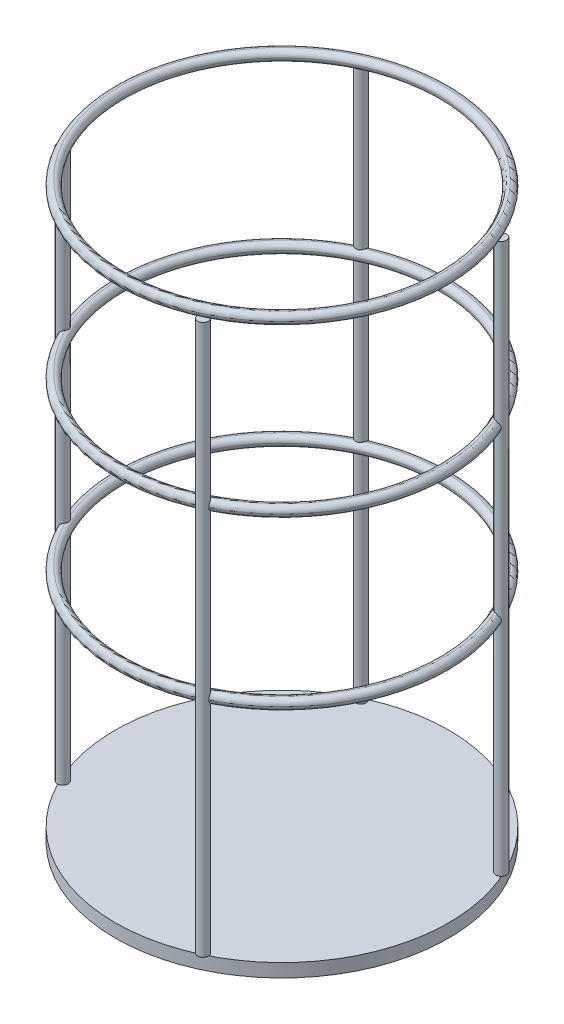
ISO-10303-21;
HEADER;
FILE_DESCRIPTION(('STEP AP214'),'2;1');
FILE_NAME('part.step','',(''),(''),'','','');
FILE_SCHEMA(('AUTOMOTIVE_DESIGN { 1 0 10303 214 1 1 1 1 }'));
ENDSEC;
DATA;
#1=APPLICATION_CONTEXT('core data for automotive mechanical design processes');
#2=APPLICATION_PROTOCOL_DEFINITION('international standard','automotive_design',2000,#1);
#3=PRODUCT_CONTEXT('',#1,'mechanical');
#4=PRODUCT('Part','Part','',(#3));
#5=PRODUCT_RELATED_PRODUCT_CATEGORY('part','',(#4));
#6=PRODUCT_DEFINITION_FORMATION('','',#4);
#7=PRODUCT_DEFINITION_CONTEXT('part definition',#1,'design');
#8=PRODUCT_DEFINITION('design','',#6,#7);
#9=PRODUCT_DEFINITION_SHAPE('','',#8);
#10=(LENGTH_UNIT() NAMED_UNIT(*) SI_UNIT(.MILLI.,.METRE.));
#11=(NAMED_UNIT(*) PLANE_ANGLE_UNIT() SI_UNIT($,.RADIAN.));
#12=(NAMED_UNIT(*) SI_UNIT($,.STERADIAN.) SOLID_ANGLE_UNIT());
#13=UNCERTAINTY_MEASURE_WITH_UNIT(LENGTH_MEASURE(1.E-05),#10,'distance_accuracy_value','');
#14=(GEOMETRIC_REPRESENTATION_CONTEXT(3) GLOBAL_UNCERTAINTY_ASSIGNED_CONTEXT((#13)) GLOBAL_UNIT_ASSIGNED_CONTEXT((#10,
#11,#12)) REPRESENTATION_CONTEXT('',''));
#15=CARTESIAN_POINT('',(0.,0.,0.));
#16=DIRECTION('',(0.,0.,1.));
#17=DIRECTION('',(1.,0.,0.));
#18=AXIS2_PLACEMENT_3D('',#15,#16,#17);
#19=CARTESIAN_POINT('',(162.767296420549,283.917533729383,-43.1274805345419));
#20=DIRECTION('',(-4.24118400981444E-06,0.999999999942017,-9.89844791380165E-06));
#21=DIRECTION('',(0.834404027641825,8.99442287995101E-06,0.551153262327458));
#22=AXIS2_PLACEMENT_3D('',#19,#20,#21);
#23=TOROIDAL_SURFACE('',#22,121.,4.);
#24=CARTESIAN_POINT('',(162.767296420549,283.917533729383,-43.1274805345419));
#25=DIRECTION('',(-4.24118400981444E-06,0.999999999942017,-9.89844791380165E-06));
#26=DIRECTION('',(0.834404027641825,8.99442287995101E-06,0.551153262327458));
#27=AXIS2_PLACEMENT_3D('',#24,#25,#26);
#28=CIRCLE('',#27,125.);
#29=CARTESIAN_POINT('',(267.067799875777,283.918658032243,25.7666772563903));
#30=VERTEX_POINT('',#29);
#31=EDGE_CURVE('P0_E21',#30,#30,#28,.F.);
#32=ORIENTED_EDGE('',*,*,#31,.F.);
#33=EDGE_LOOP('',(#32));
#34=FACE_BOUND('',#33,.T.);
#35=CARTESIAN_POINT('',(162.767279455813,287.917533729152,-43.1275201283336));
#36=DIRECTION('',(-4.24118400981444E-06,0.999999999942017,-9.89844791380165E-06));
#37=DIRECTION('',(0.834404027641825,8.99442287995101E-06,0.551153262327458));
#38=AXIS2_PLACEMENT_3D('',#35,#36,#37);
#39=CIRCLE('',#38,121.);
#40=CARTESIAN_POINT('',(263.730166800474,287.91862205432,23.5620246132889));
#41=VERTEX_POINT('',#40);
#42=EDGE_CURVE('P0_E10',#41,#41,#39,.T.);
#43=ORIENTED_EDGE('',*,*,#42,.F.);
#44=EDGE_LOOP('',(#43));
#45=FACE_BOUND('',#44,.T.);
#46=ADVANCED_FACE('P0_F15',(#34,#45),#23,.T.);
#47=CARTESIAN_POINT('',(162.767296420549,283.917533729383,-43.1274805345419));
#48=DIRECTION('',(-4.24118400981444E-06,0.999999999942017,-9.89844791380165E-06));
#49=DIRECTION('',(0.834404027641825,8.99442287995101E-06,0.551153262327458));
#50=AXIS2_PLACEMENT_3D('',#47,#48,#49);
#51=TOROIDAL_SURFACE('',#50,121.,4.);
#52=ORIENTED_EDGE('',*,*,#42,.T.);
#53=EDGE_LOOP('',(#52));
#54=FACE_BOUND('',#53,.T.);
#55=CARTESIAN_POINT('',(162.767296420549,283.917533729383,-43.1274805345419));
#56=DIRECTION('',(-4.24118400981444E-06,0.999999999942017,-9.89844791380165E-06));
#57=DIRECTION('',(0.834404027641825,8.99442287995101E-06,0.551153262327458));
#58=AXIS2_PLACEMENT_3D('',#55,#56,#57);
#59=CIRCLE('',#58,117.);
#60=CARTESIAN_POINT('',(260.392567654642,283.91858607686,21.3574511577707));
#61=VERTEX_POINT('',#60);
#62=EDGE_CURVE('P0_E25',#61,#61,#59,.T.);
#63=ORIENTED_EDGE('',*,*,#62,.F.);
#64=EDGE_LOOP('',(#63));
#65=FACE_BOUND('',#64,.T.);
#66=ADVANCED_FACE('P0_F39',(#54,#65),#51,.T.);
#67=CARTESIAN_POINT('',(162.767296420549,283.917533729383,-43.1274805345419));
#68=DIRECTION('',(-4.24118400981444E-06,0.999999999942017,-9.89844791380165E-06));
#69=DIRECTION('',(0.834404027641825,8.99442287995101E-06,0.551153262327458));
#70=AXIS2_PLACEMENT_3D('',#67,#68,#69);
#71=TOROIDAL_SURFACE('',#70,121.,4.);
#72=ORIENTED_EDGE('',*,*,#31,.T.);
#73=EDGE_LOOP('',(#72));
#74=FACE_BOUND('',#73,.T.);
#75=CARTESIAN_POINT('',(162.767313385285,279.917533729615,-43.1274409407503));
#76=DIRECTION('',(-4.24118400981444E-06,0.999999999942017,-9.89844791380165E-06));
#77=DIRECTION('',(0.834404027641825,8.99442287995101E-06,0.551153262327458));
#78=AXIS2_PLACEMENT_3D('',#75,#76,#77);
#79=CIRCLE('',#78,121.);
#80=CARTESIAN_POINT('',(263.730200729946,279.918622054784,23.5621038008722));
#81=VERTEX_POINT('',#80);
#82=EDGE_CURVE('P0_E29',#81,#81,#79,.F.);
#83=ORIENTED_EDGE('',*,*,#82,.F.);
#84=EDGE_LOOP('',(#83));
#85=FACE_BOUND('',#84,.T.);
#86=ADVANCED_FACE('P0_F37',(#74,#85),#71,.T.);
#87=CARTESIAN_POINT('',(162.767296420549,283.917533729383,-43.1274805345419));
#88=DIRECTION('',(-4.24118400981444E-06,0.999999999942017,-9.89844791380165E-06));
#89=DIRECTION('',(0.834404027641825,8.99442287995101E-06,0.551153262327458));
#90=AXIS2_PLACEMENT_3D('',#87,#88,#89);
#91=TOROIDAL_SURFACE('',#90,121.,4.);
#92=ORIENTED_EDGE('',*,*,#62,.T.);
#93=EDGE_LOOP('',(#92));
#94=FACE_BOUND('',#93,.T.);
#95=ORIENTED_EDGE('',*,*,#82,.T.);
#96=EDGE_LOOP('',(#95));
#97=FACE_BOUND('',#96,.T.);
#98=ADVANCED_FACE('P0_F35',(#94,#97),#91,.T.);
#99=CLOSED_SHELL('',(#46,#66,#86,#98));
#100=MANIFOLD_SOLID_BREP('P0_B1',#99);
#101=CARTESIAN_POINT('',(162.766589262561,158.917533743879,-43.1257130805516));
#102=DIRECTION('',(-4.24118400981444E-06,0.999999999942017,-9.89844791380165E-06));
#103=DIRECTION('',(0.834404027641825,8.99442287995101E-06,0.551153262327458));
#104=AXIS2_PLACEMENT_3D('',#101,#102,#103);
#105=TOROIDAL_SURFACE('',#104,121.,4.);
#106=CARTESIAN_POINT('',(162.766589262561,158.917533743879,-43.1257130805516));
#107=DIRECTION('',(-4.24118400981444E-06,0.999999999942017,-9.89844791380165E-06));
#108=DIRECTION('',(0.834404027641825,8.99442287995101E-06,0.551153262327458));
#109=AXIS2_PLACEMENT_3D('',#106,#107,#108);
#110=CIRCLE('',#109,125.);
#111=CARTESIAN_POINT('',(267.067092717789,158.918658046739,25.7684447103807));
#112=VERTEX_POINT('',#111);
#113=EDGE_CURVE('P1_E21',#112,#112,#110,.F.);
#114=ORIENTED_EDGE('',*,*,#113,.F.);
#115=EDGE_LOOP('',(#114));
#116=FACE_BOUND('',#115,.T.);
#117=CARTESIAN_POINT('',(162.766572297825,162.917533743647,-43.1257526743432));
#118=DIRECTION('',(-4.24118400981444E-06,0.999999999942017,-9.89844791380165E-06));
#119=DIRECTION('',(0.834404027641825,8.99442287995101E-06,0.551153262327458));
#120=AXIS2_PLACEMENT_3D('',#117,#118,#119);
#121=CIRCLE('',#120,121.);
#122=CARTESIAN_POINT('',(263.729459642485,162.918622068816,23.5637920672792));
#123=VERTEX_POINT('',#122);
#124=EDGE_CURVE('P1_E10',#123,#123,#121,.T.);
#125=ORIENTED_EDGE('',*,*,#124,.F.);
#126=EDGE_LOOP('',(#125));
#127=FACE_BOUND('',#126,.T.);
#128=ADVANCED_FACE('P1_F15',(#116,#127),#105,.T.);
#129=CARTESIAN_POINT('',(162.766589262561,158.917533743879,-43.1257130805516));
#130=DIRECTION('',(-4.24118400981444E-06,0.999999999942017,-9.89844791380165E-06));
#131=DIRECTION('',(0.834404027641825,8.99442287995101E-06,0.551153262327458));
#132=AXIS2_PLACEMENT_3D('',#129,#130,#131);
#133=TOROIDAL_SURFACE('',#132,121.,4.);
#134=ORIENTED_EDGE('',*,*,#124,.T.);
#135=EDGE_LOOP('',(#134));
#136=FACE_BOUND('',#135,.T.);
#137=CARTESIAN_POINT('',(162.766589262561,158.917533743879,-43.1257130805516));
#138=DIRECTION('',(-4.24118400981444E-06,0.999999999942017,-9.89844791380165E-06));
#139=DIRECTION('',(0.834404027641825,8.99442287995101E-06,0.551153262327458));
#140=AXIS2_PLACEMENT_3D('',#137,#138,#139);
#141=CIRCLE('',#140,117.);
#142=CARTESIAN_POINT('',(260.391860496654,158.918586091356,21.3592186117611));
#143=VERTEX_POINT('',#142);
#144=EDGE_CURVE('P1_E25',#143,#143,#141,.T.);
#145=ORIENTED_EDGE('',*,*,#144,.F.);
#146=EDGE_LOOP('',(#145));
#147=FACE_BOUND('',#146,.T.);
#148=ADVANCED_FACE('P1_F39',(#136,#147),#133,.T.);
#149=CARTESIAN_POINT('',(162.766589262561,158.917533743879,-43.1257130805516));
#150=DIRECTION('',(-4.24118400981444E-06,0.999999999942017,-9.89844791380165E-06));
#151=DIRECTION('',(0.834404027641825,8.99442287995101E-06,0.551153262327458));
#152=AXIS2_PLACEMENT_3D('',#149,#150,#151);
#153=TOROIDAL_SURFACE('',#152,121.,4.);
#154=ORIENTED_EDGE('',*,*,#113,.T.);
#155=EDGE_LOOP('',(#154));
#156=FACE_BOUND('',#155,.T.);
#157=CARTESIAN_POINT('',(162.766606227297,154.917533744111,-43.1256734867599));
#158=DIRECTION('',(-4.24118400981444E-06,0.999999999942017,-9.89844791380165E-06));
#159=DIRECTION('',(0.834404027641825,8.99442287995101E-06,0.551153262327458));
#160=AXIS2_PLACEMENT_3D('',#157,#158,#159);
#161=CIRCLE('',#160,121.);
#162=CARTESIAN_POINT('',(263.729493571958,154.91862206928,23.5638712548625));
#163=VERTEX_POINT('',#162);
#164=EDGE_CURVE('P1_E29',#163,#163,#161,.F.);
#165=ORIENTED_EDGE('',*,*,#164,.F.);
#166=EDGE_LOOP('',(#165));
#167=FACE_BOUND('',#166,.T.);
#168=ADVANCED_FACE('P1_F37',(#156,#167),#153,.T.);
#169=CARTESIAN_POINT('',(162.766589262561,158.917533743879,-43.1257130805516));
#170=DIRECTION('',(-4.24118400981444E-06,0.999999999942017,-9.89844791380165E-06));
#171=DIRECTION('',(0.834404027641825,8.99442287995101E-06,0.551153262327458));
#172=AXIS2_PLACEMENT_3D('',#169,#170,#171);
#173=TOROIDAL_SURFACE('',#172,121.,4.);
#174=ORIENTED_EDGE('',*,*,#144,.T.);
#175=EDGE_LOOP('',(#174));
#176=FACE_BOUND('',#175,.T.);
#177=ORIENTED_EDGE('',*,*,#164,.T.);
#178=EDGE_LOOP('',(#177));
#179=FACE_BOUND('',#178,.T.);
#180=ADVANCED_FACE('P1_F35',(#176,#179),#173,.T.);
#181=CLOSED_SHELL('',(#128,#148,#168,#180));
#182=MANIFOLD_SOLID_BREP('P1_B1',#181);
#183=CARTESIAN_POINT('',(162.765882104573,33.9175337583752,-43.1239456265612));
#184=DIRECTION('',(-4.24118400981444E-06,0.999999999942017,-9.89844791380165E-06));
#185=DIRECTION('',(0.834404027641825,8.99442287995101E-06,0.551153262327458));
#186=AXIS2_PLACEMENT_3D('',#183,#184,#185);
#187=TOROIDAL_SURFACE('',#186,121.,4.);
#188=CARTESIAN_POINT('',(162.765882104573,33.9175337583752,-43.1239456265612));
#189=DIRECTION('',(-4.24118400981444E-06,0.999999999942017,-9.89844791380165E-06));
#190=DIRECTION('',(0.834404027641825,8.99442287995101E-06,0.551153262327458));
#191=AXIS2_PLACEMENT_3D('',#188,#189,#190);
#192=CIRCLE('',#191,125.);
#193=CARTESIAN_POINT('',(267.066385559801,33.9186580612352,25.7702121643711));
#194=VERTEX_POINT('',#193);
#195=EDGE_CURVE('P2_E20',#194,#194,#192,.F.);
#196=ORIENTED_EDGE('',*,*,#195,.F.);
#197=EDGE_LOOP('',(#196));
#198=FACE_BOUND('',#197,.T.);
#199=CARTESIAN_POINT('',(162.765865139837,37.9175337581433,-43.1239852203528));
#200=DIRECTION('',(-4.24118400981444E-06,0.999999999942017,-9.89844791380165E-06));
#201=DIRECTION('',(0.834404027641825,8.99442287995101E-06,0.551153262327458));
#202=AXIS2_PLACEMENT_3D('',#199,#200,#201);
#203=CIRCLE('',#202,121.);
#204=CARTESIAN_POINT('',(263.728752484497,37.9186220833118,23.5655595212696));
#205=VERTEX_POINT('',#204);
#206=EDGE_CURVE('P2_E9',#205,#205,#203,.T.);
#207=ORIENTED_EDGE('',*,*,#206,.F.);
#208=EDGE_LOOP('',(#207));
#209=FACE_BOUND('',#208,.T.);
#210=ADVANCED_FACE('P2_F14',(#198,#209),#187,.T.);
#211=CARTESIAN_POINT('',(162.765882104573,33.9175337583752,-43.1239456265612));
#212=DIRECTION('',(-4.24118400981444E-06,0.999999999942017,-9.89844791380165E-06));
#213=DIRECTION('',(0.834404027641825,8.99442287995101E-06,0.551153262327458));
#214=AXIS2_PLACEMENT_3D('',#211,#212,#213);
#215=TOROIDAL_SURFACE('',#214,121.,4.);
#216=ORIENTED_EDGE('',*,*,#206,.T.);
#217=EDGE_LOOP('',(#216));
#218=FACE_BOUND('',#217,.T.);
#219=CARTESIAN_POINT('',(162.765882104573,33.9175337583752,-43.1239456265612));
#220=DIRECTION('',(-4.24118400981444E-06,0.999999999942017,-9.89844791380165E-06));
#221=DIRECTION('',(0.834404027641825,8.99442287995101E-06,0.551153262327458));
#222=AXIS2_PLACEMENT_3D('',#219,#220,#221);
#223=CIRCLE('',#222,117.);
#224=CARTESIAN_POINT('',(260.391153338666,33.9185861058522,21.3609860657514));
#225=VERTEX_POINT('',#224);
#226=EDGE_CURVE('P2_E24',#225,#225,#223,.T.);
#227=ORIENTED_EDGE('',*,*,#226,.F.);
#228=EDGE_LOOP('',(#227));
#229=FACE_BOUND('',#228,.T.);
#230=ADVANCED_FACE('P2_F38',(#218,#229),#215,.T.);
#231=CARTESIAN_POINT('',(162.765882104573,33.9175337583752,-43.1239456265612));
#232=DIRECTION('',(-4.24118400981444E-06,0.999999999942017,-9.89844791380165E-06));
#233=DIRECTION('',(0.834404027641825,8.99442287995101E-06,0.551153262327458));
#234=AXIS2_PLACEMENT_3D('',#231,#232,#233);
#235=TOROIDAL_SURFACE('',#234,121.,4.);
#236=ORIENTED_EDGE('',*,*,#195,.T.);
#237=EDGE_LOOP('',(#236));
#238=FACE_BOUND('',#237,.T.);
#239=CARTESIAN_POINT('',(162.765899069309,29.9175337586071,-43.1239060327695));
#240=DIRECTION('',(-4.24118400981444E-06,0.999999999942017,-9.89844791380165E-06));
#241=DIRECTION('',(0.834404027641825,8.99442287995101E-06,0.551153262327458));
#242=AXIS2_PLACEMENT_3D('',#239,#240,#241);
#243=CIRCLE('',#242,121.);
#244=CARTESIAN_POINT('',(263.72878641397,29.9186220837756,23.5656387088529));
#245=VERTEX_POINT('',#244);
#246=EDGE_CURVE('P2_E28',#245,#245,#243,.F.);
#247=ORIENTED_EDGE('',*,*,#246,.F.);
#248=EDGE_LOOP('',(#247));
#249=FACE_BOUND('',#248,.T.);
#250=ADVANCED_FACE('P2_F36',(#238,#249),#235,.T.);
#251=CARTESIAN_POINT('',(162.765882104573,33.9175337583752,-43.1239456265612));
#252=DIRECTION('',(-4.24118400981444E-06,0.999999999942017,-9.89844791380165E-06));
#253=DIRECTION('',(0.834404027641825,8.99442287995101E-06,0.551153262327458));
#254=AXIS2_PLACEMENT_3D('',#251,#252,#253);
#255=TOROIDAL_SURFACE('',#254,121.,4.);
#256=ORIENTED_EDGE('',*,*,#226,.T.);
#257=EDGE_LOOP('',(#256));
#258=FACE_BOUND('',#257,.T.);
#259=ORIENTED_EDGE('',*,*,#246,.T.);
#260=EDGE_LOOP('',(#259));
#261=FACE_BOUND('',#260,.T.);
#262=ADVANCED_FACE('P2_F34',(#258,#261),#255,.T.);
#263=CLOSED_SHELL('',(#210,#230,#250,#262));
#264=MANIFOLD_SOLID_BREP('P2_B1',#263);
#265=CARTESIAN_POINT('',(162.770825081858,-132.082454183985,-43.1192450322442));
#266=DIRECTION('',(8.48236801908888E-06,-0.999999999768066,1.97968958263428E-05));
#267=DIRECTION('',(8.39621596496115E-11,-1.97968958263428E-05,-0.999999999804042));
#268=AXIS2_PLACEMENT_3D('',#265,#266,#267);
#269=CYLINDRICAL_SURFACE('',#268,125.);
#270=CARTESIAN_POINT('',(162.770825081858,-132.082454183985,-43.1192450322442));
#271=DIRECTION('',(-8.48236801908888E-06,0.999999999768066,-1.97968958263428E-05));
#272=DIRECTION('',(-8.39621596496115E-11,1.97968958263428E-05,0.999999999804042));
#273=AXIS2_PLACEMENT_3D('',#270,#271,#272);
#274=CIRCLE('',#273,125.);
#275=CARTESIAN_POINT('',(162.770825071363,-132.079979572007,81.880754943261));
#276=VERTEX_POINT('',#275);
#277=EDGE_CURVE('P3_E10',#276,#276,#274,.T.);
#278=ORIENTED_EDGE('',*,*,#277,.F.);
#279=EDGE_LOOP('',(#278));
#280=FACE_BOUND('',#279,.T.);
#281=CARTESIAN_POINT('',(162.770909905538,-142.082454181665,-43.1190470632859));
#282=DIRECTION('',(-8.48236801908888E-06,0.999999999768066,-1.97968958263428E-05));
#283=DIRECTION('',(-8.39621596496115E-11,1.97968958263428E-05,0.999999999804042));
#284=AXIS2_PLACEMENT_3D('',#281,#282,#283);
#285=CIRCLE('',#284,125.);
#286=CARTESIAN_POINT('',(162.770909895043,-142.079979569687,81.8809529122193));
#287=VERTEX_POINT('',#286);
#288=EDGE_CURVE('P3_E18',#287,#287,#285,.T.);
#289=ORIENTED_EDGE('',*,*,#288,.T.);
#290=EDGE_LOOP('',(#289));
#291=FACE_BOUND('',#290,.T.);
#292=ADVANCED_FACE('P3_F15',(#280,#291),#269,.T.);
#293=CARTESIAN_POINT('',(162.770825081858,-132.082454183985,-43.1192450322442));
#294=DIRECTION('',(-8.48236801908888E-06,0.999999999768066,-1.97968958263428E-05));
#295=DIRECTION('',(-8.39621596496115E-11,1.97968958263428E-05,0.999999999804042));
#296=AXIS2_PLACEMENT_3D('',#293,#294,#295);
#297=PLANE('',#296);
#298=ORIENTED_EDGE('',*,*,#277,.T.);
#299=EDGE_LOOP('',(#298));
#300=FACE_BOUND('',#299,.T.);
#301=ADVANCED_FACE('P3_F30',(#300),#297,.T.);
#302=CARTESIAN_POINT('',(162.770909905538,-142.082454181665,-43.1190470632859));
#303=DIRECTION('',(-8.48236801908888E-06,0.999999999768066,-1.97968958263428E-05));
#304=DIRECTION('',(-8.39621596496115E-11,1.97968958263428E-05,0.999999999804042));
#305=AXIS2_PLACEMENT_3D('',#302,#303,#304);
#306=PLANE('',#305);
#307=ORIENTED_EDGE('',*,*,#288,.F.);
#308=EDGE_LOOP('',(#307));
#309=FACE_BOUND('',#308,.T.);
#310=ADVANCED_FACE('P3_F28',(#309),#306,.F.);
#311=CLOSED_SHELL('',(#292,#301,#310));
#312=MANIFOLD_SOLID_BREP('P3_B1',#311);
#313=CARTESIAN_POINT('',(51.0623898512348,279.917545719531,9.43961345081953));
#314=DIRECTION('',(0.,-1.,0.));
#315=DIRECTION('',(0.878405205040862,0.,-0.47791662008882));
#316=AXIS2_PLACEMENT_3D('',#313,#314,#315);
#317=CYLINDRICAL_SURFACE('',#316,4.);
#318=CARTESIAN_POINT('',(51.0623898512348,279.917545719531,9.43961345081953));
#319=DIRECTION('',(0.,1.,0.));
#320=DIRECTION('',(-0.878405205040862,0.,0.47791662008882));
#321=AXIS2_PLACEMENT_3D('',#318,#319,#320);
#322=CIRCLE('',#321,4.);
#323=CARTESIAN_POINT('',(47.5487690310713,279.917545719531,11.3512799311748));
#324=VERTEX_POINT('',#323);
#325=EDGE_CURVE('P4_E10',#324,#324,#322,.T.);
#326=ORIENTED_EDGE('',*,*,#325,.F.);
#327=EDGE_LOOP('',(#326));
#328=FACE_BOUND('',#327,.T.);
#329=CARTESIAN_POINT('',(51.0623898512348,-132.082454280469,9.43961345081953));
#330=DIRECTION('',(0.,1.,0.));
#331=DIRECTION('',(-0.878405205040862,0.,0.47791662008882));
#332=AXIS2_PLACEMENT_3D('',#329,#330,#331);
#333=CIRCLE('',#332,4.);
#334=CARTESIAN_POINT('',(47.5487690310713,-132.082454280469,11.3512799311748));
#335=VERTEX_POINT('',#334);
#336=EDGE_CURVE('P4_E18',#335,#335,#333,.T.);
#337=ORIENTED_EDGE('',*,*,#336,.T.);
#338=EDGE_LOOP('',(#337));
#339=FACE_BOUND('',#338,.T.);
#340=ADVANCED_FACE('P4_F15',(#328,#339),#317,.T.);
#341=CARTESIAN_POINT('',(51.0623898512348,279.917545719531,9.43961345081953));
#342=DIRECTION('',(0.,1.,0.));
#343=DIRECTION('',(-0.878405205040862,0.,0.47791662008882));
#344=AXIS2_PLACEMENT_3D('',#341,#342,#343);
#345=PLANE('',#344);
#346=ORIENTED_EDGE('',*,*,#325,.T.);
#347=EDGE_LOOP('',(#346));
#348=FACE_BOUND('',#347,.T.);
#349=ADVANCED_FACE('P4_F30',(#348),#345,.T.);
#350=CARTESIAN_POINT('',(51.0623898512348,-132.082454280469,9.43961345081953));
#351=DIRECTION('',(0.,1.,0.));
#352=DIRECTION('',(-0.878405205040862,0.,0.47791662008882));
#353=AXIS2_PLACEMENT_3D('',#350,#351,#352);
#354=PLANE('',#353);
#355=ORIENTED_EDGE('',*,*,#336,.F.);
#356=EDGE_LOOP('',(#355));
#357=FACE_BOUND('',#356,.T.);
#358=ADVANCED_FACE('P4_F28',(#357),#354,.F.);
#359=CLOSED_SHELL('',(#340,#349,#358));
#360=MANIFOLD_SOLID_BREP('P4_B1',#359);
#361=CARTESIAN_POINT('',(110.20025899679,279.916170496498,-154.83236446793));
#362=DIRECTION('',(1.41396319233701E-05,-0.999999999884033,5.65726390341316E-06));
#363=DIRECTION('',(0.477916620056855,1.17269351577284E-05,0.878405204979974));
#364=AXIS2_PLACEMENT_3D('',#361,#362,#363);
#365=CYLINDRICAL_SURFACE('',#364,4.);
#366=CARTESIAN_POINT('',(110.20025899679,279.916170496498,-154.83236446793));
#367=DIRECTION('',(-1.41396319233701E-05,0.999999999884033,-5.65726390341316E-06));
#368=DIRECTION('',(-0.477916620056855,-1.17269351577284E-05,-0.878405204979974));
#369=AXIS2_PLACEMENT_3D('',#366,#367,#368);
#370=CIRCLE('',#369,4.);
#371=CARTESIAN_POINT('',(108.288592516562,279.916123588758,-158.345985287849));
#372=VERTEX_POINT('',#371);
#373=EDGE_CURVE('P5_E10',#372,#372,#370,.T.);
#374=ORIENTED_EDGE('',*,*,#373,.F.);
#375=EDGE_LOOP('',(#374));
#376=FACE_BOUND('',#375,.T.);
#377=CARTESIAN_POINT('',(110.206084525142,-132.083829455723,-154.830033675201));
#378=DIRECTION('',(-1.41396319233701E-05,0.999999999884033,-5.65726390341316E-06));
#379=DIRECTION('',(-0.477916620056855,-1.17269351577284E-05,-0.878405204979974));
#380=AXIS2_PLACEMENT_3D('',#377,#378,#379);
#381=CIRCLE('',#380,4.);
#382=CARTESIAN_POINT('',(108.294418044915,-132.083876363464,-158.343654495121));
#383=VERTEX_POINT('',#382);
#384=EDGE_CURVE('P5_E18',#383,#383,#381,.T.);
#385=ORIENTED_EDGE('',*,*,#384,.T.);
#386=EDGE_LOOP('',(#385));
#387=FACE_BOUND('',#386,.T.);
#388=ADVANCED_FACE('P5_F15',(#376,#387),#365,.T.);
#389=CARTESIAN_POINT('',(110.20025899679,279.916170496498,-154.83236446793));
#390=DIRECTION('',(-1.41396319233701E-05,0.999999999884033,-5.65726390341316E-06));
#391=DIRECTION('',(-0.477916620056855,-1.17269351577284E-05,-0.878405204979974));
#392=AXIS2_PLACEMENT_3D('',#389,#390,#391);
#393=PLANE('',#392);
#394=ORIENTED_EDGE('',*,*,#373,.T.);
#395=EDGE_LOOP('',(#394));
#396=FACE_BOUND('',#395,.T.);
#397=ADVANCED_FACE('P5_F30',(#396),#393,.T.);
#398=CARTESIAN_POINT('',(110.206084525142,-132.083829455723,-154.830033675201));
#399=DIRECTION('',(-1.41396319233701E-05,0.999999999884033,-5.65726390341316E-06));
#400=DIRECTION('',(-0.477916620056855,-1.17269351577284E-05,-0.878405204979974));
#401=AXIS2_PLACEMENT_3D('',#398,#399,#400);
#402=PLANE('',#401);
#403=ORIENTED_EDGE('',*,*,#384,.F.);
#404=EDGE_LOOP('',(#403));
#405=FACE_BOUND('',#404,.T.);
#406=ADVANCED_FACE('P5_F28',(#405),#402,.F.);
#407=CLOSED_SHELL('',(#388,#397,#406));
#408=MANIFOLD_SOLID_BREP('P5_B1',#407);
#409=CARTESIAN_POINT('',(215.334367774072,279.918827800334,68.5774825871139));
#410=DIRECTION('',(-5.65726390423311E-06,-0.999999999884033,1.41396319230422E-05));
#411=DIRECTION('',(-0.477916620065375,-9.71662583518054E-06,-0.878405204999877));
#412=AXIS2_PLACEMENT_3D('',#409,#410,#411);
#413=CYLINDRICAL_SURFACE('',#412,4.);
#414=CARTESIAN_POINT('',(215.334367774072,279.918827800334,68.5774825871139));
#415=DIRECTION('',(5.65726390423311E-06,0.999999999884033,-1.41396319230422E-05));
#416=DIRECTION('',(0.477916620065375,9.71662583518054E-06,0.878405204999877));
#417=AXIS2_PLACEMENT_3D('',#414,#415,#416);
#418=CIRCLE('',#417,4.);
#419=CARTESIAN_POINT('',(217.246034254334,279.918866666837,72.0911034071134));
#420=VERTEX_POINT('',#419);
#421=EDGE_CURVE('P6_E10',#420,#420,#418,.T.);
#422=ORIENTED_EDGE('',*,*,#421,.F.);
#423=EDGE_LOOP('',(#422));
#424=FACE_BOUND('',#423,.T.);
#425=CARTESIAN_POINT('',(215.332036981344,-132.081172151888,68.5833081154662));
#426=DIRECTION('',(5.65726390423311E-06,0.999999999884033,-1.41396319230422E-05));
#427=DIRECTION('',(0.477916620065375,9.71662583518054E-06,0.878405204999877));
#428=AXIS2_PLACEMENT_3D('',#425,#426,#427);
#429=CIRCLE('',#428,4.);
#430=CARTESIAN_POINT('',(217.243703461605,-132.081133285384,72.0969289354657));
#431=VERTEX_POINT('',#430);
#432=EDGE_CURVE('P6_E18',#431,#431,#429,.T.);
#433=ORIENTED_EDGE('',*,*,#432,.T.);
#434=EDGE_LOOP('',(#433));
#435=FACE_BOUND('',#434,.T.);
#436=ADVANCED_FACE('P6_F15',(#424,#435),#413,.T.);
#437=CARTESIAN_POINT('',(215.334367774072,279.918827800334,68.5774825871139));
#438=DIRECTION('',(5.65726390423311E-06,0.999999999884033,-1.41396319230422E-05));
#439=DIRECTION('',(0.477916620065375,9.71662583518054E-06,0.878405204999877));
#440=AXIS2_PLACEMENT_3D('',#437,#438,#439);
#441=PLANE('',#440);
#442=ORIENTED_EDGE('',*,*,#421,.T.);
#443=EDGE_LOOP('',(#442));
#444=FACE_BOUND('',#443,.T.);
#445=ADVANCED_FACE('P6_F30',(#444),#441,.T.);
#446=CARTESIAN_POINT('',(215.332036981344,-132.081172151888,68.5833081154662));
#447=DIRECTION('',(5.65726390423311E-06,0.999999999884033,-1.41396319230422E-05));
#448=DIRECTION('',(0.477916620065375,9.71662583518054E-06,0.878405204999877));
#449=AXIS2_PLACEMENT_3D('',#446,#447,#448);
#450=PLANE('',#449);
#451=ORIENTED_EDGE('',*,*,#432,.F.);
#452=EDGE_LOOP('',(#451));
#453=FACE_BOUND('',#452,.T.);
#454=ADVANCED_FACE('P6_F28',(#453),#450,.F.);
#455=CLOSED_SHELL('',(#436,#445,#454));
#456=MANIFOLD_SOLID_BREP('P6_B1',#455);
#457=CARTESIAN_POINT('',(274.472236919628,279.917452577302,-95.6944953316363));
#458=DIRECTION('',(8.48236801913712E-06,-0.999999999768066,1.97968958264554E-05));
#459=DIRECTION('',(-0.878405205049385,2.01030932254798E-06,0.477916620068927));
#460=AXIS2_PLACEMENT_3D('',#457,#458,#459);
#461=CYLINDRICAL_SURFACE('',#460,4.);
#462=CARTESIAN_POINT('',(274.472236919628,279.917452577302,-95.6944953316363));
#463=DIRECTION('',(-8.48236801913712E-06,0.999999999768066,-1.97968958264554E-05));
#464=DIRECTION('',(0.878405205049385,-2.01030932254798E-06,-0.477916620068927));
#465=AXIS2_PLACEMENT_3D('',#462,#463,#464);
#466=CIRCLE('',#465,4.);
#467=CARTESIAN_POINT('',(277.985857739825,279.917444536065,-97.606161811912));
#468=VERTEX_POINT('',#467);
#469=EDGE_CURVE('P7_E10',#468,#468,#466,.T.);
#470=ORIENTED_EDGE('',*,*,#469,.F.);
#471=EDGE_LOOP('',(#470));
#472=FACE_BOUND('',#471,.T.);
#473=CARTESIAN_POINT('',(274.475731655252,-132.082547327141,-95.6863390105558));
#474=DIRECTION('',(-8.48236801913712E-06,0.999999999768066,-1.97968958264554E-05));
#475=DIRECTION('',(0.878405205049385,-2.01030932254798E-06,-0.477916620068927));
#476=AXIS2_PLACEMENT_3D('',#473,#474,#475);
#477=CIRCLE('',#476,4.);
#478=CARTESIAN_POINT('',(277.989352475449,-132.082555368379,-97.5980054908315));
#479=VERTEX_POINT('',#478);
#480=EDGE_CURVE('P7_E18',#479,#479,#477,.T.);
#481=ORIENTED_EDGE('',*,*,#480,.T.);
#482=EDGE_LOOP('',(#481));
#483=FACE_BOUND('',#482,.T.);
#484=ADVANCED_FACE('P7_F15',(#472,#483),#461,.T.);
#485=CARTESIAN_POINT('',(274.472236919628,279.917452577302,-95.6944953316363));
#486=DIRECTION('',(-8.48236801913712E-06,0.999999999768066,-1.97968958264554E-05));
#487=DIRECTION('',(0.878405205049385,-2.01030932254798E-06,-0.477916620068927));
#488=AXIS2_PLACEMENT_3D('',#485,#486,#487);
#489=PLANE('',#488);
#490=ORIENTED_EDGE('',*,*,#469,.T.);
#491=EDGE_LOOP('',(#490));
#492=FACE_BOUND('',#491,.T.);
#493=ADVANCED_FACE('P7_F30',(#492),#489,.T.);
#494=CARTESIAN_POINT('',(274.475731655252,-132.082547327141,-95.6863390105558));
#495=DIRECTION('',(-8.48236801913712E-06,0.999999999768066,-1.97968958264554E-05));
#496=DIRECTION('',(0.878405205049385,-2.01030932254798E-06,-0.477916620068927));
#497=AXIS2_PLACEMENT_3D('',#494,#495,#496);
#498=PLANE('',#497);
#499=ORIENTED_EDGE('',*,*,#480,.F.);
#500=EDGE_LOOP('',(#499));
#501=FACE_BOUND('',#500,.T.);
#502=ADVANCED_FACE('P7_F28',(#501),#498,.F.);
#503=CLOSED_SHELL('',(#484,#493,#502));
#504=MANIFOLD_SOLID_BREP('P7_B1',#503);
#505=ADVANCED_BREP_SHAPE_REPRESENTATION('',(#18,#100,#182,#264,#312,#360,#408,#456,#504),#14);
#506=SHAPE_DEFINITION_REPRESENTATION(#9,#505);
ENDSEC;
END-ISO-10303-21;
